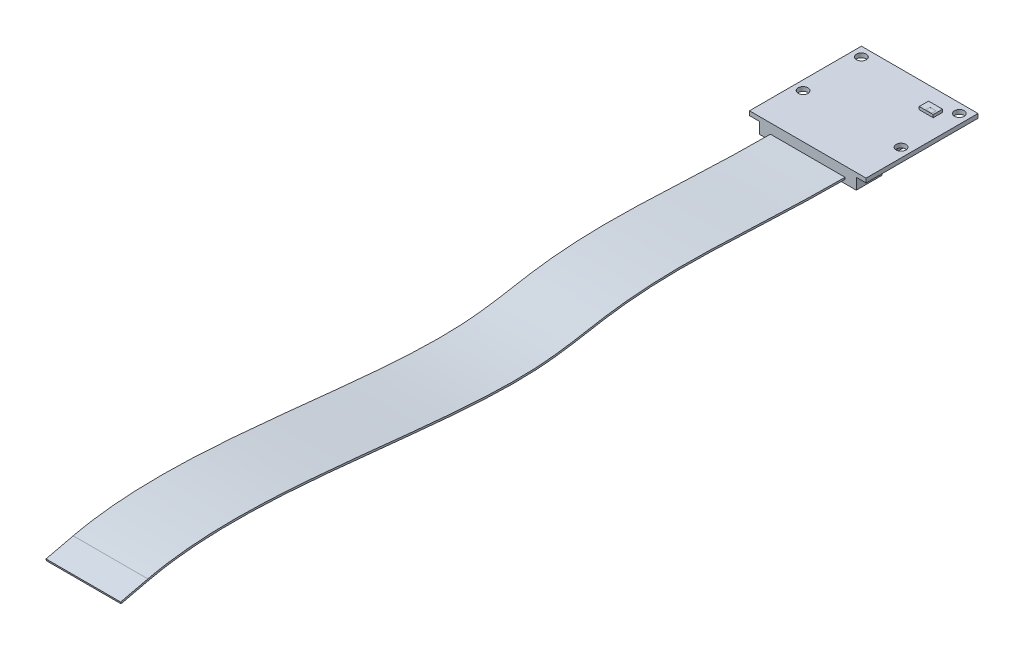
ISO-10303-21;
HEADER;
FILE_DESCRIPTION(('STEP AP214'),'2;1');
FILE_NAME('part.step','',(''),(''),'','','');
FILE_SCHEMA(('AUTOMOTIVE_DESIGN { 1 0 10303 214 1 1 1 1 }'));
ENDSEC;
DATA;
#1=APPLICATION_CONTEXT('core data for automotive mechanical design processes');
#2=APPLICATION_PROTOCOL_DEFINITION('international standard','automotive_design',2000,#1);
#3=PRODUCT_CONTEXT('',#1,'mechanical');
#4=PRODUCT('Part','Part','',(#3));
#5=PRODUCT_RELATED_PRODUCT_CATEGORY('part','',(#4));
#6=PRODUCT_DEFINITION_FORMATION('','',#4);
#7=PRODUCT_DEFINITION_CONTEXT('part definition',#1,'design');
#8=PRODUCT_DEFINITION('design','',#6,#7);
#9=PRODUCT_DEFINITION_SHAPE('','',#8);
#10=(LENGTH_UNIT() NAMED_UNIT(*) SI_UNIT(.MILLI.,.METRE.));
#11=(NAMED_UNIT(*) PLANE_ANGLE_UNIT() SI_UNIT($,.RADIAN.));
#12=(NAMED_UNIT(*) SI_UNIT($,.STERADIAN.) SOLID_ANGLE_UNIT());
#13=UNCERTAINTY_MEASURE_WITH_UNIT(LENGTH_MEASURE(1.E-05),#10,'distance_accuracy_value','');
#14=(GEOMETRIC_REPRESENTATION_CONTEXT(3) GLOBAL_UNCERTAINTY_ASSIGNED_CONTEXT((#13)) GLOBAL_UNIT_ASSIGNED_CONTEXT((#10,
#11,#12)) REPRESENTATION_CONTEXT('',''));
#15=CARTESIAN_POINT('',(0.,0.,0.));
#16=DIRECTION('',(0.,0.,1.));
#17=DIRECTION('',(1.,0.,0.));
#18=AXIS2_PLACEMENT_3D('',#15,#16,#17);
#19=CARTESIAN_POINT('',(0.,0.,0.));
#20=DIRECTION('',(0.,1.,0.));
#21=DIRECTION('',(0.,0.,1.));
#22=AXIS2_PLACEMENT_3D('',#19,#20,#21);
#23=PLANE('',#22);
#24=CARTESIAN_POINT('',(-10.5,0.,-12.5));
#25=DIRECTION('',(0.,1.,0.));
#26=DIRECTION('',(0.,0.,-1.));
#27=AXIS2_PLACEMENT_3D('',#24,#25,#26);
#28=CIRCLE('',#27,1.05);
#29=CARTESIAN_POINT('',(-10.5,0.,-13.55));
#30=VERTEX_POINT('',#29);
#31=EDGE_CURVE('E504',#30,#30,#28,.T.);
#32=ORIENTED_EDGE('',*,*,#31,.F.);
#33=EDGE_LOOP('',(#32));
#34=FACE_BOUND('',#33,.T.);
#35=CARTESIAN_POINT('',(-10.5,0.,0.));
#36=DIRECTION('',(0.,1.,0.));
#37=DIRECTION('',(0.,0.,-1.));
#38=AXIS2_PLACEMENT_3D('',#35,#36,#37);
#39=CIRCLE('',#38,1.05);
#40=CARTESIAN_POINT('',(-10.5,0.,-1.05));
#41=VERTEX_POINT('',#40);
#42=EDGE_CURVE('E510',#41,#41,#39,.T.);
#43=ORIENTED_EDGE('',*,*,#42,.F.);
#44=EDGE_LOOP('',(#43));
#45=FACE_BOUND('',#44,.T.);
#46=CARTESIAN_POINT('',(10.5,0.,0.));
#47=DIRECTION('',(0.,1.,0.));
#48=DIRECTION('',(0.,0.,1.));
#49=AXIS2_PLACEMENT_3D('',#46,#47,#48);
#50=CIRCLE('',#49,1.05);
#51=CARTESIAN_POINT('',(10.5,0.,1.05));
#52=VERTEX_POINT('',#51);
#53=EDGE_CURVE('E515',#52,#52,#50,.T.);
#54=ORIENTED_EDGE('',*,*,#53,.F.);
#55=EDGE_LOOP('',(#54));
#56=FACE_BOUND('',#55,.T.);
#57=CARTESIAN_POINT('',(10.5,0.,-12.5));
#58=DIRECTION('',(0.,1.,0.));
#59=DIRECTION('',(0.,0.,1.));
#60=AXIS2_PLACEMENT_3D('',#57,#58,#59);
#61=CIRCLE('',#60,1.05);
#62=CARTESIAN_POINT('',(10.5,0.,-11.45));
#63=VERTEX_POINT('',#62);
#64=EDGE_CURVE('E521',#63,#63,#61,.T.);
#65=ORIENTED_EDGE('',*,*,#64,.F.);
#66=EDGE_LOOP('',(#65));
#67=FACE_BOUND('',#66,.T.);
#68=DIRECTION('',(0.,0.,1.));
#69=VECTOR('',#68,1.);
#70=CARTESIAN_POINT('',(-12.5,0.,-14.5));
#71=LINE('',#70,#69);
#72=CARTESIAN_POINT('',(-12.5,0.,-14.5));
#73=VERTEX_POINT('',#72);
#74=CARTESIAN_POINT('',(-12.5,0.,9.5));
#75=VERTEX_POINT('',#74);
#76=EDGE_CURVE('E458',#73,#75,#71,.T.);
#77=ORIENTED_EDGE('',*,*,#76,.T.);
#78=DIRECTION('',(1.,0.,0.));
#79=VECTOR('',#78,1.);
#80=CARTESIAN_POINT('',(-12.5,0.,9.5));
#81=LINE('',#80,#79);
#82=CARTESIAN_POINT('',(12.5,0.,9.5));
#83=VERTEX_POINT('',#82);
#84=EDGE_CURVE('E461',#75,#83,#81,.T.);
#85=ORIENTED_EDGE('',*,*,#84,.T.);
#86=DIRECTION('',(0.,0.,-1.));
#87=VECTOR('',#86,1.);
#88=CARTESIAN_POINT('',(12.5,0.,-14.5));
#89=LINE('',#88,#87);
#90=CARTESIAN_POINT('',(12.5,0.,-14.5));
#91=VERTEX_POINT('',#90);
#92=EDGE_CURVE('E465',#83,#91,#89,.T.);
#93=ORIENTED_EDGE('',*,*,#92,.T.);
#94=DIRECTION('',(-1.,0.,0.));
#95=VECTOR('',#94,1.);
#96=CARTESIAN_POINT('',(-12.5,0.,-14.5));
#97=LINE('',#96,#95);
#98=EDGE_CURVE('E468',#91,#73,#97,.T.);
#99=ORIENTED_EDGE('',*,*,#98,.T.);
#100=EDGE_LOOP('',(#77,#85,#93,#99));
#101=FACE_BOUND('',#100,.T.);
#102=DIRECTION('',(1.,0.,0.));
#103=VECTOR('',#102,1.);
#104=CARTESIAN_POINT('',(5.5,0.,-8.90000000000001));
#105=LINE('',#104,#103);
#106=CARTESIAN_POINT('',(5.5,0.,-8.90000000000001));
#107=VERTEX_POINT('',#106);
#108=CARTESIAN_POINT('',(8.5,0.,-8.90000000000001));
#109=VERTEX_POINT('',#108);
#110=EDGE_CURVE('E280',#107,#109,#105,.T.);
#111=ORIENTED_EDGE('',*,*,#110,.F.);
#112=DIRECTION('',(0.,0.,1.));
#113=VECTOR('',#112,1.);
#114=CARTESIAN_POINT('',(5.5,0.,-10.9));
#115=LINE('',#114,#113);
#116=CARTESIAN_POINT('',(5.5,0.,-10.9));
#117=VERTEX_POINT('',#116);
#118=EDGE_CURVE('E263',#117,#107,#115,.T.);
#119=ORIENTED_EDGE('',*,*,#118,.F.);
#120=DIRECTION('',(-1.,0.,0.));
#121=VECTOR('',#120,1.);
#122=CARTESIAN_POINT('',(5.5,0.,-10.9));
#123=LINE('',#122,#121);
#124=CARTESIAN_POINT('',(8.5,0.,-10.9));
#125=VERTEX_POINT('',#124);
#126=EDGE_CURVE('E271',#125,#117,#123,.T.);
#127=ORIENTED_EDGE('',*,*,#126,.F.);
#128=DIRECTION('',(0.,0.,-1.));
#129=VECTOR('',#128,1.);
#130=CARTESIAN_POINT('',(8.5,0.,-10.9));
#131=LINE('',#130,#129);
#132=EDGE_CURVE('E282',#109,#125,#131,.T.);
#133=ORIENTED_EDGE('',*,*,#132,.F.);
#134=EDGE_LOOP('',(#111,#119,#127,#133));
#135=FACE_BOUND('',#134,.T.);
#136=ADVANCED_FACE('F53',(#34,#45,#56,#67,#101,#135),#23,.T.);
#137=CARTESIAN_POINT('',(0.,-0.9,0.));
#138=DIRECTION('',(0.,1.,0.));
#139=DIRECTION('',(0.,0.,1.));
#140=AXIS2_PLACEMENT_3D('',#137,#138,#139);
#141=PLANE('',#140);
#142=DIRECTION('',(0.,0.,-1.));
#143=VECTOR('',#142,1.);
#144=CARTESIAN_POINT('',(-10.4,-0.9,9.5));
#145=LINE('',#144,#143);
#146=CARTESIAN_POINT('',(-10.4,-0.9,9.5));
#147=VERTEX_POINT('',#146);
#148=CARTESIAN_POINT('',(-10.4,-0.9,4.));
#149=VERTEX_POINT('',#148);
#150=EDGE_CURVE('E400',#147,#149,#145,.T.);
#151=ORIENTED_EDGE('',*,*,#150,.F.);
#152=DIRECTION('',(1.,0.,0.));
#153=VECTOR('',#152,1.);
#154=CARTESIAN_POINT('',(-12.5,-0.9,9.5));
#155=LINE('',#154,#153);
#156=CARTESIAN_POINT('',(-12.5,-0.9,9.5));
#157=VERTEX_POINT('',#156);
#158=EDGE_CURVE('E443',#157,#147,#155,.T.);
#159=ORIENTED_EDGE('',*,*,#158,.F.);
#160=DIRECTION('',(0.,0.,1.));
#161=VECTOR('',#160,1.);
#162=CARTESIAN_POINT('',(-12.5,-0.9,-14.5));
#163=LINE('',#162,#161);
#164=CARTESIAN_POINT('',(-12.5,-0.9,-14.5));
#165=VERTEX_POINT('',#164);
#166=EDGE_CURVE('E444',#165,#157,#163,.T.);
#167=ORIENTED_EDGE('',*,*,#166,.F.);
#168=DIRECTION('',(-1.,0.,0.));
#169=VECTOR('',#168,1.);
#170=CARTESIAN_POINT('',(-12.5,-0.9,-14.5));
#171=LINE('',#170,#169);
#172=CARTESIAN_POINT('',(12.5,-0.9,-14.5));
#173=VERTEX_POINT('',#172);
#174=EDGE_CURVE('E454',#173,#165,#171,.T.);
#175=ORIENTED_EDGE('',*,*,#174,.F.);
#176=DIRECTION('',(0.,0.,-1.));
#177=VECTOR('',#176,1.);
#178=CARTESIAN_POINT('',(12.5,-0.9,-14.5));
#179=LINE('',#178,#177);
#180=CARTESIAN_POINT('',(12.5,-0.9,9.5));
#181=VERTEX_POINT('',#180);
#182=EDGE_CURVE('E450',#181,#173,#179,.T.);
#183=ORIENTED_EDGE('',*,*,#182,.F.);
#184=CARTESIAN_POINT('',(10.4,-0.9,9.5));
#185=VERTEX_POINT('',#184);
#186=EDGE_CURVE('E440',#185,#181,#155,.T.);
#187=ORIENTED_EDGE('',*,*,#186,.F.);
#188=DIRECTION('',(0.,0.,1.));
#189=VECTOR('',#188,1.);
#190=CARTESIAN_POINT('',(10.4,-0.9,9.5));
#191=LINE('',#190,#189);
#192=CARTESIAN_POINT('',(10.4,-0.9,4.));
#193=VERTEX_POINT('',#192);
#194=EDGE_CURVE('E405',#193,#185,#191,.T.);
#195=ORIENTED_EDGE('',*,*,#194,.F.);
#196=DIRECTION('',(1.,0.,0.));
#197=VECTOR('',#196,1.);
#198=CARTESIAN_POINT('',(-10.4,-0.9,4.));
#199=LINE('',#198,#197);
#200=EDGE_CURVE('E412',#149,#193,#199,.T.);
#201=ORIENTED_EDGE('',*,*,#200,.F.);
#202=EDGE_LOOP('',(#151,#159,#167,#175,#183,#187,#195,#201));
#203=FACE_BOUND('',#202,.T.);
#204=CARTESIAN_POINT('',(-10.5,-0.9,-12.5));
#205=DIRECTION('',(0.,1.,0.));
#206=DIRECTION('',(0.,0.,-1.));
#207=AXIS2_PLACEMENT_3D('',#204,#205,#206);
#208=CIRCLE('',#207,1.05);
#209=CARTESIAN_POINT('',(-10.5,-0.9,-13.55));
#210=VERTEX_POINT('',#209);
#211=EDGE_CURVE('E506',#210,#210,#208,.T.);
#212=ORIENTED_EDGE('',*,*,#211,.T.);
#213=EDGE_LOOP('',(#212));
#214=FACE_BOUND('',#213,.T.);
#215=CARTESIAN_POINT('',(-10.5,-0.9,0.));
#216=DIRECTION('',(0.,1.,0.));
#217=DIRECTION('',(0.,0.,-1.));
#218=AXIS2_PLACEMENT_3D('',#215,#216,#217);
#219=CIRCLE('',#218,1.05);
#220=CARTESIAN_POINT('',(-10.5,-0.9,-1.05));
#221=VERTEX_POINT('',#220);
#222=EDGE_CURVE('E512',#221,#221,#219,.T.);
#223=ORIENTED_EDGE('',*,*,#222,.T.);
#224=EDGE_LOOP('',(#223));
#225=FACE_BOUND('',#224,.T.);
#226=CARTESIAN_POINT('',(10.5,-0.9,0.));
#227=DIRECTION('',(0.,1.,0.));
#228=DIRECTION('',(0.,0.,1.));
#229=AXIS2_PLACEMENT_3D('',#226,#227,#228);
#230=CIRCLE('',#229,1.05);
#231=CARTESIAN_POINT('',(10.5,-0.9,1.05));
#232=VERTEX_POINT('',#231);
#233=EDGE_CURVE('E518',#232,#232,#230,.T.);
#234=ORIENTED_EDGE('',*,*,#233,.T.);
#235=EDGE_LOOP('',(#234));
#236=FACE_BOUND('',#235,.T.);
#237=CARTESIAN_POINT('',(10.5,-0.9,-12.5));
#238=DIRECTION('',(0.,1.,0.));
#239=DIRECTION('',(0.,0.,1.));
#240=AXIS2_PLACEMENT_3D('',#237,#238,#239);
#241=CIRCLE('',#240,1.05);
#242=CARTESIAN_POINT('',(10.5,-0.9,-11.45));
#243=VERTEX_POINT('',#242);
#244=EDGE_CURVE('E462',#243,#243,#241,.T.);
#245=ORIENTED_EDGE('',*,*,#244,.T.);
#246=EDGE_LOOP('',(#245));
#247=FACE_BOUND('',#246,.T.);
#248=DIRECTION('',(0.,0.,-1.));
#249=VECTOR('',#248,1.);
#250=CARTESIAN_POINT('',(-9.,-0.9,-0.900000000000005));
#251=LINE('',#250,#249);
#252=CARTESIAN_POINT('',(-9.,-0.9,-0.900000000000005));
#253=VERTEX_POINT('',#252);
#254=CARTESIAN_POINT('',(-9.,-0.9,-12.5));
#255=VERTEX_POINT('',#254);
#256=EDGE_CURVE('E367',#253,#255,#251,.T.);
#257=ORIENTED_EDGE('',*,*,#256,.F.);
#258=DIRECTION('',(-1.,0.,0.));
#259=VECTOR('',#258,1.);
#260=CARTESIAN_POINT('',(-9.,-0.9,-0.900000000000005));
#261=LINE('',#260,#259);
#262=CARTESIAN_POINT('',(8.7,-0.9,-0.900000000000005));
#263=VERTEX_POINT('',#262);
#264=EDGE_CURVE('E372',#263,#253,#261,.T.);
#265=ORIENTED_EDGE('',*,*,#264,.F.);
#266=DIRECTION('',(0.,0.,1.));
#267=VECTOR('',#266,1.);
#268=CARTESIAN_POINT('',(8.7,-0.9,-0.900000000000005));
#269=LINE('',#268,#267);
#270=CARTESIAN_POINT('',(8.7,-0.9,-12.5));
#271=VERTEX_POINT('',#270);
#272=EDGE_CURVE('E384',#271,#263,#269,.T.);
#273=ORIENTED_EDGE('',*,*,#272,.F.);
#274=DIRECTION('',(1.,0.,0.));
#275=VECTOR('',#274,1.);
#276=CARTESIAN_POINT('',(-9.,-0.9,-12.5));
#277=LINE('',#276,#275);
#278=EDGE_CURVE('E381',#255,#271,#277,.T.);
#279=ORIENTED_EDGE('',*,*,#278,.F.);
#280=EDGE_LOOP('',(#257,#265,#273,#279));
#281=FACE_BOUND('',#280,.T.);
#282=ADVANCED_FACE('F490',(#203,#214,#225,#236,#247,#281),#141,.F.);
#283=CARTESIAN_POINT('',(-12.5,-0.9,-14.5));
#284=DIRECTION('',(-1.,0.,0.));
#285=DIRECTION('',(0.,0.,1.));
#286=AXIS2_PLACEMENT_3D('',#283,#284,#285);
#287=PLANE('',#286);
#288=ORIENTED_EDGE('',*,*,#76,.F.);
#289=DIRECTION('',(0.,1.,0.));
#290=VECTOR('',#289,1.);
#291=CARTESIAN_POINT('',(-12.5,-0.9,-14.5));
#292=LINE('',#291,#290);
#293=EDGE_CURVE('E12',#165,#73,#292,.T.);
#294=ORIENTED_EDGE('',*,*,#293,.F.);
#295=ORIENTED_EDGE('',*,*,#166,.T.);
#296=DIRECTION('',(0.,1.,0.));
#297=VECTOR('',#296,1.);
#298=CARTESIAN_POINT('',(-12.5,-0.9,9.5));
#299=LINE('',#298,#297);
#300=EDGE_CURVE('E457',#157,#75,#299,.T.);
#301=ORIENTED_EDGE('',*,*,#300,.T.);
#302=EDGE_LOOP('',(#288,#294,#295,#301));
#303=FACE_BOUND('',#302,.T.);
#304=ADVANCED_FACE('F55',(#303),#287,.T.);
#305=CARTESIAN_POINT('',(-12.5,-0.9,-14.5));
#306=DIRECTION('',(0.,0.,-1.));
#307=DIRECTION('',(-1.,0.,0.));
#308=AXIS2_PLACEMENT_3D('',#305,#306,#307);
#309=PLANE('',#308);
#310=ORIENTED_EDGE('',*,*,#98,.F.);
#311=DIRECTION('',(0.,1.,0.));
#312=VECTOR('',#311,1.);
#313=CARTESIAN_POINT('',(12.5,-0.9,-14.5));
#314=LINE('',#313,#312);
#315=EDGE_CURVE('E62',#173,#91,#314,.T.);
#316=ORIENTED_EDGE('',*,*,#315,.F.);
#317=ORIENTED_EDGE('',*,*,#174,.T.);
#318=ORIENTED_EDGE('',*,*,#293,.T.);
#319=EDGE_LOOP('',(#310,#316,#317,#318));
#320=FACE_BOUND('',#319,.T.);
#321=ADVANCED_FACE('F487',(#320),#309,.T.);
#322=CARTESIAN_POINT('',(12.5,-0.9,-14.5));
#323=DIRECTION('',(1.,0.,0.));
#324=DIRECTION('',(0.,0.,-1.));
#325=AXIS2_PLACEMENT_3D('',#322,#323,#324);
#326=PLANE('',#325);
#327=ORIENTED_EDGE('',*,*,#92,.F.);
#328=DIRECTION('',(0.,1.,0.));
#329=VECTOR('',#328,1.);
#330=CARTESIAN_POINT('',(12.5,-0.9,9.5));
#331=LINE('',#330,#329);
#332=EDGE_CURVE('E472',#181,#83,#331,.T.);
#333=ORIENTED_EDGE('',*,*,#332,.F.);
#334=ORIENTED_EDGE('',*,*,#182,.T.);
#335=ORIENTED_EDGE('',*,*,#315,.T.);
#336=EDGE_LOOP('',(#327,#333,#334,#335));
#337=FACE_BOUND('',#336,.T.);
#338=ADVANCED_FACE('F545',(#337),#326,.T.);
#339=CARTESIAN_POINT('',(-12.5,-0.9,9.5));
#340=DIRECTION('',(0.,0.,1.));
#341=DIRECTION('',(1.,0.,0.));
#342=AXIS2_PLACEMENT_3D('',#339,#340,#341);
#343=PLANE('',#342);
#344=DIRECTION('',(0.,-1.,0.));
#345=VECTOR('',#344,1.);
#346=CARTESIAN_POINT('',(-8.,-2.1,9.5));
#347=LINE('',#346,#345);
#348=CARTESIAN_POINT('',(-8.,-2.1,9.5));
#349=VERTEX_POINT('',#348);
#350=CARTESIAN_POINT('',(-8.,-2.5,9.5));
#351=VERTEX_POINT('',#350);
#352=EDGE_CURVE('E294',#349,#351,#347,.T.);
#353=ORIENTED_EDGE('',*,*,#352,.F.);
#354=DIRECTION('',(-1.,0.,0.));
#355=VECTOR('',#354,1.);
#356=CARTESIAN_POINT('',(-8.,-2.1,9.5));
#357=LINE('',#356,#355);
#358=CARTESIAN_POINT('',(8.,-2.1,9.5));
#359=VERTEX_POINT('',#358);
#360=EDGE_CURVE('E304',#359,#349,#357,.T.);
#361=ORIENTED_EDGE('',*,*,#360,.F.);
#362=DIRECTION('',(0.,1.,0.));
#363=VECTOR('',#362,1.);
#364=CARTESIAN_POINT('',(8.,-2.1,9.5));
#365=LINE('',#364,#363);
#366=CARTESIAN_POINT('',(8.,-2.5,9.5));
#367=VERTEX_POINT('',#366);
#368=EDGE_CURVE('E301',#367,#359,#365,.T.);
#369=ORIENTED_EDGE('',*,*,#368,.F.);
#370=DIRECTION('',(1.,0.,0.));
#371=VECTOR('',#370,1.);
#372=CARTESIAN_POINT('',(-8.,-2.5,9.5));
#373=LINE('',#372,#371);
#374=EDGE_CURVE('E297',#351,#367,#373,.T.);
#375=ORIENTED_EDGE('',*,*,#374,.F.);
#376=EDGE_LOOP('',(#353,#361,#369,#375));
#377=FACE_BOUND('',#376,.T.);
#378=ORIENTED_EDGE('',*,*,#84,.F.);
#379=ORIENTED_EDGE('',*,*,#300,.F.);
#380=ORIENTED_EDGE('',*,*,#158,.T.);
#381=DIRECTION('',(0.,1.,0.));
#382=VECTOR('',#381,1.);
#383=CARTESIAN_POINT('',(-10.4,-3.3,9.5));
#384=LINE('',#383,#382);
#385=CARTESIAN_POINT('',(-10.4,-3.3,9.5));
#386=VERTEX_POINT('',#385);
#387=EDGE_CURVE('E411',#386,#147,#384,.T.);
#388=ORIENTED_EDGE('',*,*,#387,.F.);
#389=DIRECTION('',(-1.,0.,0.));
#390=VECTOR('',#389,1.);
#391=CARTESIAN_POINT('',(-10.4,-3.3,9.5));
#392=LINE('',#391,#390);
#393=CARTESIAN_POINT('',(10.4,-3.3,9.5));
#394=VERTEX_POINT('',#393);
#395=EDGE_CURVE('E409',#394,#386,#392,.T.);
#396=ORIENTED_EDGE('',*,*,#395,.F.);
#397=DIRECTION('',(0.,1.,0.));
#398=VECTOR('',#397,1.);
#399=CARTESIAN_POINT('',(10.4,-3.3,9.5));
#400=LINE('',#399,#398);
#401=EDGE_CURVE('E424',#394,#185,#400,.T.);
#402=ORIENTED_EDGE('',*,*,#401,.T.);
#403=ORIENTED_EDGE('',*,*,#186,.T.);
#404=ORIENTED_EDGE('',*,*,#332,.T.);
#405=EDGE_LOOP('',(#378,#379,#380,#388,#396,#402,#403,#404));
#406=FACE_BOUND('',#405,.T.);
#407=ADVANCED_FACE('F480',(#377,#406),#343,.T.);
#408=CARTESIAN_POINT('',(10.5,-0.9,-12.5));
#409=DIRECTION('',(0.,1.,0.));
#410=DIRECTION('',(0.,0.,1.));
#411=AXIS2_PLACEMENT_3D('',#408,#409,#410);
#412=CYLINDRICAL_SURFACE('',#411,1.05);
#413=ORIENTED_EDGE('',*,*,#244,.F.);
#414=EDGE_LOOP('',(#413));
#415=FACE_BOUND('',#414,.T.);
#416=ORIENTED_EDGE('',*,*,#64,.T.);
#417=EDGE_LOOP('',(#416));
#418=FACE_BOUND('',#417,.T.);
#419=ADVANCED_FACE('F528',(#415,#418),#412,.F.);
#420=CARTESIAN_POINT('',(10.5,-0.9,0.));
#421=DIRECTION('',(0.,1.,0.));
#422=DIRECTION('',(0.,0.,1.));
#423=AXIS2_PLACEMENT_3D('',#420,#421,#422);
#424=CYLINDRICAL_SURFACE('',#423,1.05);
#425=ORIENTED_EDGE('',*,*,#233,.F.);
#426=EDGE_LOOP('',(#425));
#427=FACE_BOUND('',#426,.T.);
#428=ORIENTED_EDGE('',*,*,#53,.T.);
#429=EDGE_LOOP('',(#428));
#430=FACE_BOUND('',#429,.T.);
#431=ADVANCED_FACE('F555',(#427,#430),#424,.F.);
#432=CARTESIAN_POINT('',(-10.5,-0.9,0.));
#433=DIRECTION('',(0.,1.,0.));
#434=DIRECTION('',(0.,0.,1.));
#435=AXIS2_PLACEMENT_3D('',#432,#433,#434);
#436=CYLINDRICAL_SURFACE('',#435,1.05);
#437=ORIENTED_EDGE('',*,*,#222,.F.);
#438=EDGE_LOOP('',(#437));
#439=FACE_BOUND('',#438,.T.);
#440=ORIENTED_EDGE('',*,*,#42,.T.);
#441=EDGE_LOOP('',(#440));
#442=FACE_BOUND('',#441,.T.);
#443=ADVANCED_FACE('F623',(#439,#442),#436,.F.);
#444=CARTESIAN_POINT('',(-10.5,-0.9,-12.5));
#445=DIRECTION('',(0.,1.,0.));
#446=DIRECTION('',(0.,0.,1.));
#447=AXIS2_PLACEMENT_3D('',#444,#445,#446);
#448=CYLINDRICAL_SURFACE('',#447,1.05);
#449=ORIENTED_EDGE('',*,*,#211,.F.);
#450=EDGE_LOOP('',(#449));
#451=FACE_BOUND('',#450,.T.);
#452=ORIENTED_EDGE('',*,*,#31,.T.);
#453=EDGE_LOOP('',(#452));
#454=FACE_BOUND('',#453,.T.);
#455=ADVANCED_FACE('F620',(#451,#454),#448,.F.);
#456=CARTESIAN_POINT('',(-10.4,-3.3,9.5));
#457=DIRECTION('',(1.,0.,0.));
#458=DIRECTION('',(0.,0.,-1.));
#459=AXIS2_PLACEMENT_3D('',#456,#457,#458);
#460=PLANE('',#459);
#461=ORIENTED_EDGE('',*,*,#150,.T.);
#462=DIRECTION('',(0.,1.,0.));
#463=VECTOR('',#462,1.);
#464=CARTESIAN_POINT('',(-10.4,-3.3,4.));
#465=LINE('',#464,#463);
#466=CARTESIAN_POINT('',(-10.4,-3.3,4.));
#467=VERTEX_POINT('',#466);
#468=EDGE_CURVE('E430',#467,#149,#465,.T.);
#469=ORIENTED_EDGE('',*,*,#468,.F.);
#470=DIRECTION('',(0.,0.,-1.));
#471=VECTOR('',#470,1.);
#472=CARTESIAN_POINT('',(-10.4,-3.3,9.5));
#473=LINE('',#472,#471);
#474=EDGE_CURVE('E401',#386,#467,#473,.T.);
#475=ORIENTED_EDGE('',*,*,#474,.F.);
#476=ORIENTED_EDGE('',*,*,#387,.T.);
#477=EDGE_LOOP('',(#461,#469,#475,#476));
#478=FACE_BOUND('',#477,.T.);
#479=ADVANCED_FACE('F494',(#478),#460,.F.);
#480=CARTESIAN_POINT('',(-10.4,-3.3,4.));
#481=DIRECTION('',(0.,0.,1.));
#482=DIRECTION('',(1.,0.,0.));
#483=AXIS2_PLACEMENT_3D('',#480,#481,#482);
#484=PLANE('',#483);
#485=ORIENTED_EDGE('',*,*,#200,.T.);
#486=DIRECTION('',(0.,1.,0.));
#487=VECTOR('',#486,1.);
#488=CARTESIAN_POINT('',(10.4,-3.3,4.));
#489=LINE('',#488,#487);
#490=CARTESIAN_POINT('',(10.4,-3.3,4.));
#491=VERTEX_POINT('',#490);
#492=EDGE_CURVE('E417',#491,#193,#489,.T.);
#493=ORIENTED_EDGE('',*,*,#492,.F.);
#494=DIRECTION('',(1.,0.,0.));
#495=VECTOR('',#494,1.);
#496=CARTESIAN_POINT('',(-10.4,-3.3,4.));
#497=LINE('',#496,#495);
#498=EDGE_CURVE('E404',#467,#491,#497,.T.);
#499=ORIENTED_EDGE('',*,*,#498,.F.);
#500=ORIENTED_EDGE('',*,*,#468,.T.);
#501=EDGE_LOOP('',(#485,#493,#499,#500));
#502=FACE_BOUND('',#501,.T.);
#503=ADVANCED_FACE('F503',(#502),#484,.F.);
#504=CARTESIAN_POINT('',(10.4,-3.3,9.5));
#505=DIRECTION('',(-1.,0.,0.));
#506=DIRECTION('',(0.,0.,1.));
#507=AXIS2_PLACEMENT_3D('',#504,#505,#506);
#508=PLANE('',#507);
#509=ORIENTED_EDGE('',*,*,#194,.T.);
#510=ORIENTED_EDGE('',*,*,#401,.F.);
#511=DIRECTION('',(0.,0.,1.));
#512=VECTOR('',#511,1.);
#513=CARTESIAN_POINT('',(10.4,-3.3,9.5));
#514=LINE('',#513,#512);
#515=EDGE_CURVE('E407',#491,#394,#514,.T.);
#516=ORIENTED_EDGE('',*,*,#515,.F.);
#517=ORIENTED_EDGE('',*,*,#492,.T.);
#518=EDGE_LOOP('',(#509,#510,#516,#517));
#519=FACE_BOUND('',#518,.T.);
#520=ADVANCED_FACE('F501',(#519),#508,.F.);
#521=CARTESIAN_POINT('',(0.,-3.3,0.));
#522=DIRECTION('',(0.,-1.,0.));
#523=DIRECTION('',(0.,0.,-1.));
#524=AXIS2_PLACEMENT_3D('',#521,#522,#523);
#525=PLANE('',#524);
#526=ORIENTED_EDGE('',*,*,#474,.T.);
#527=ORIENTED_EDGE('',*,*,#498,.T.);
#528=ORIENTED_EDGE('',*,*,#515,.T.);
#529=ORIENTED_EDGE('',*,*,#395,.T.);
#530=EDGE_LOOP('',(#526,#527,#528,#529));
#531=FACE_BOUND('',#530,.T.);
#532=ADVANCED_FACE('F497',(#531),#525,.T.);
#533=CARTESIAN_POINT('',(-9.,-2.2,-0.900000000000005));
#534=DIRECTION('',(1.,0.,0.));
#535=DIRECTION('',(0.,0.,-1.));
#536=AXIS2_PLACEMENT_3D('',#533,#534,#535);
#537=PLANE('',#536);
#538=ORIENTED_EDGE('',*,*,#256,.T.);
#539=DIRECTION('',(0.,1.,0.));
#540=VECTOR('',#539,1.);
#541=CARTESIAN_POINT('',(-9.,-2.2,-12.5));
#542=LINE('',#541,#540);
#543=CARTESIAN_POINT('',(-9.,-2.2,-12.5));
#544=VERTEX_POINT('',#543);
#545=EDGE_CURVE('E397',#544,#255,#542,.T.);
#546=ORIENTED_EDGE('',*,*,#545,.F.);
#547=DIRECTION('',(0.,0.,-1.));
#548=VECTOR('',#547,1.);
#549=CARTESIAN_POINT('',(-9.,-2.2,-0.900000000000005));
#550=LINE('',#549,#548);
#551=CARTESIAN_POINT('',(-9.,-2.2,-0.900000000000005));
#552=VERTEX_POINT('',#551);
#553=EDGE_CURVE('E368',#552,#544,#550,.T.);
#554=ORIENTED_EDGE('',*,*,#553,.F.);
#555=DIRECTION('',(0.,1.,0.));
#556=VECTOR('',#555,1.);
#557=CARTESIAN_POINT('',(-9.,-2.2,-0.900000000000005));
#558=LINE('',#557,#556);
#559=EDGE_CURVE('E378',#552,#253,#558,.T.);
#560=ORIENTED_EDGE('',*,*,#559,.T.);
#561=EDGE_LOOP('',(#538,#546,#554,#560));
#562=FACE_BOUND('',#561,.T.);
#563=ADVANCED_FACE('F607',(#562),#537,.F.);
#564=CARTESIAN_POINT('',(-9.,-2.2,-12.5));
#565=DIRECTION('',(0.,0.,1.));
#566=DIRECTION('',(1.,0.,0.));
#567=AXIS2_PLACEMENT_3D('',#564,#565,#566);
#568=PLANE('',#567);
#569=ORIENTED_EDGE('',*,*,#278,.T.);
#570=DIRECTION('',(0.,1.,0.));
#571=VECTOR('',#570,1.);
#572=CARTESIAN_POINT('',(8.7,-2.2,-12.5));
#573=LINE('',#572,#571);
#574=CARTESIAN_POINT('',(8.7,-2.2,-12.5));
#575=VERTEX_POINT('',#574);
#576=EDGE_CURVE('E394',#575,#271,#573,.T.);
#577=ORIENTED_EDGE('',*,*,#576,.F.);
#578=DIRECTION('',(1.,0.,0.));
#579=VECTOR('',#578,1.);
#580=CARTESIAN_POINT('',(-9.,-2.2,-12.5));
#581=LINE('',#580,#579);
#582=EDGE_CURVE('E371',#544,#575,#581,.T.);
#583=ORIENTED_EDGE('',*,*,#582,.F.);
#584=ORIENTED_EDGE('',*,*,#545,.T.);
#585=EDGE_LOOP('',(#569,#577,#583,#584));
#586=FACE_BOUND('',#585,.T.);
#587=ADVANCED_FACE('F603',(#586),#568,.F.);
#588=CARTESIAN_POINT('',(8.7,-2.2,-0.900000000000005));
#589=DIRECTION('',(-1.,0.,0.));
#590=DIRECTION('',(0.,0.,1.));
#591=AXIS2_PLACEMENT_3D('',#588,#589,#590);
#592=PLANE('',#591);
#593=ORIENTED_EDGE('',*,*,#272,.T.);
#594=DIRECTION('',(0.,1.,0.));
#595=VECTOR('',#594,1.);
#596=CARTESIAN_POINT('',(8.7,-2.2,-0.900000000000005));
#597=LINE('',#596,#595);
#598=CARTESIAN_POINT('',(8.7,-2.2,-0.900000000000005));
#599=VERTEX_POINT('',#598);
#600=EDGE_CURVE('E391',#599,#263,#597,.T.);
#601=ORIENTED_EDGE('',*,*,#600,.F.);
#602=DIRECTION('',(0.,0.,1.));
#603=VECTOR('',#602,1.);
#604=CARTESIAN_POINT('',(8.7,-2.2,-0.900000000000005));
#605=LINE('',#604,#603);
#606=EDGE_CURVE('E374',#575,#599,#605,.T.);
#607=ORIENTED_EDGE('',*,*,#606,.F.);
#608=ORIENTED_EDGE('',*,*,#576,.T.);
#609=EDGE_LOOP('',(#593,#601,#607,#608));
#610=FACE_BOUND('',#609,.T.);
#611=ADVANCED_FACE('F599',(#610),#592,.F.);
#612=CARTESIAN_POINT('',(-9.,-2.2,-0.900000000000005));
#613=DIRECTION('',(0.,0.,-1.));
#614=DIRECTION('',(-1.,0.,0.));
#615=AXIS2_PLACEMENT_3D('',#612,#613,#614);
#616=PLANE('',#615);
#617=ORIENTED_EDGE('',*,*,#264,.T.);
#618=ORIENTED_EDGE('',*,*,#559,.F.);
#619=DIRECTION('',(-1.,0.,0.));
#620=VECTOR('',#619,1.);
#621=CARTESIAN_POINT('',(-9.,-2.2,-0.900000000000005));
#622=LINE('',#621,#620);
#623=EDGE_CURVE('E376',#599,#552,#622,.T.);
#624=ORIENTED_EDGE('',*,*,#623,.F.);
#625=ORIENTED_EDGE('',*,*,#600,.T.);
#626=EDGE_LOOP('',(#617,#618,#624,#625));
#627=FACE_BOUND('',#626,.T.);
#628=ADVANCED_FACE('F595',(#627),#616,.F.);
#629=CARTESIAN_POINT('',(0.,-2.2,0.));
#630=DIRECTION('',(0.,-1.,0.));
#631=DIRECTION('',(0.,0.,-1.));
#632=AXIS2_PLACEMENT_3D('',#629,#630,#631);
#633=PLANE('',#632);
#634=ORIENTED_EDGE('',*,*,#553,.T.);
#635=ORIENTED_EDGE('',*,*,#582,.T.);
#636=ORIENTED_EDGE('',*,*,#606,.T.);
#637=ORIENTED_EDGE('',*,*,#623,.T.);
#638=EDGE_LOOP('',(#634,#635,#636,#637));
#639=FACE_BOUND('',#638,.T.);
#640=ADVANCED_FACE('F584',(#639),#633,.T.);
#641=CARTESIAN_POINT('',(-8.,-2.31532924842802,158.905927829852));
#642=DIRECTION('',(0.,-0.973646751768898,-0.228061401315247));
#643=DIRECTION('',(0.,0.228061401315247,-0.973646751768898));
#644=AXIS2_PLACEMENT_3D('',#641,#642,#643);
#645=PLANE('',#644);
#646=DIRECTION('',(1.,0.,0.));
#647=VECTOR('',#646,1.);
#648=CARTESIAN_POINT('',(-8.,-2.31532924842802,158.905927829852));
#649=LINE('',#648,#647);
#650=CARTESIAN_POINT('',(-8.,-2.31532924842804,158.905927829852));
#651=VERTEX_POINT('',#650);
#652=CARTESIAN_POINT('',(8.,-2.31532924842804,158.905927829852));
#653=VERTEX_POINT('',#652);
#654=EDGE_CURVE('E293',#651,#653,#649,.T.);
#655=ORIENTED_EDGE('',*,*,#654,.T.);
#656=DIRECTION('',(0.,-0.228061401315247,0.973646751768898));
#657=VECTOR('',#656,1.);
#658=CARTESIAN_POINT('',(8.,-2.31532924842804,158.905927829852));
#659=LINE('',#658,#657);
#660=CARTESIAN_POINT('',(8.,-3.6836976563195,164.747808340466));
#661=VERTEX_POINT('',#660);
#662=EDGE_CURVE('E361',#653,#661,#659,.T.);
#663=ORIENTED_EDGE('',*,*,#662,.T.);
#664=DIRECTION('',(1.,0.,0.));
#665=VECTOR('',#664,1.);
#666=CARTESIAN_POINT('',(-8.,-3.68369765631948,164.747808340466));
#667=LINE('',#666,#665);
#668=CARTESIAN_POINT('',(-8.,-3.6836976563195,164.747808340466));
#669=VERTEX_POINT('',#668);
#670=EDGE_CURVE('E352',#669,#661,#667,.T.);
#671=ORIENTED_EDGE('',*,*,#670,.F.);
#672=DIRECTION('',(0.,-0.228061401315247,0.973646751768898));
#673=VECTOR('',#672,1.);
#674=CARTESIAN_POINT('',(-8.,-2.31532924842804,158.905927829852));
#675=LINE('',#674,#673);
#676=EDGE_CURVE('E364',#651,#669,#675,.T.);
#677=ORIENTED_EDGE('',*,*,#676,.F.);
#678=EDGE_LOOP('',(#655,#663,#671,#677));
#679=FACE_BOUND('',#678,.T.);
#680=ADVANCED_FACE('F572',(#679),#645,.T.);
#681=CARTESIAN_POINT('',(-8.,-1.92587054772046,158.997152390378));
#682=DIRECTION('',(0.,0.973646751768898,0.228061401315247));
#683=DIRECTION('',(0.,-0.228061401315247,0.973646751768898));
#684=AXIS2_PLACEMENT_3D('',#681,#682,#683);
#685=PLANE('',#684);
#686=DIRECTION('',(-1.,0.,0.));
#687=VECTOR('',#686,1.);
#688=CARTESIAN_POINT('',(-8.,-1.92587054772046,158.997152390378));
#689=LINE('',#688,#687);
#690=CARTESIAN_POINT('',(8.,-1.92587054772046,158.997152390378));
#691=VERTEX_POINT('',#690);
#692=CARTESIAN_POINT('',(-8.,-1.92587054772046,158.997152390378));
#693=VERTEX_POINT('',#692);
#694=EDGE_CURVE('E322',#691,#693,#689,.T.);
#695=ORIENTED_EDGE('',*,*,#694,.T.);
#696=DIRECTION('',(0.,-0.228061401315247,0.973646751768898));
#697=VECTOR('',#696,1.);
#698=CARTESIAN_POINT('',(-8.,-1.92587054772046,158.997152390378));
#699=LINE('',#698,#697);
#700=CARTESIAN_POINT('',(-8.,-3.29423895561192,164.839032900992));
#701=VERTEX_POINT('',#700);
#702=EDGE_CURVE('E355',#693,#701,#699,.T.);
#703=ORIENTED_EDGE('',*,*,#702,.T.);
#704=DIRECTION('',(-1.,0.,0.));
#705=VECTOR('',#704,1.);
#706=CARTESIAN_POINT('',(-8.,-3.29423895561192,164.839032900992));
#707=LINE('',#706,#705);
#708=CARTESIAN_POINT('',(8.,-3.29423895561192,164.839032900992));
#709=VERTEX_POINT('',#708);
#710=EDGE_CURVE('E346',#709,#701,#707,.T.);
#711=ORIENTED_EDGE('',*,*,#710,.F.);
#712=DIRECTION('',(0.,-0.228061401315247,0.973646751768898));
#713=VECTOR('',#712,1.);
#714=CARTESIAN_POINT('',(8.,-1.92587054772046,158.997152390378));
#715=LINE('',#714,#713);
#716=EDGE_CURVE('E358',#691,#709,#715,.T.);
#717=ORIENTED_EDGE('',*,*,#716,.F.);
#718=EDGE_LOOP('',(#695,#703,#711,#717));
#719=FACE_BOUND('',#718,.T.);
#720=ADVANCED_FACE('F576',(#719),#685,.T.);
#721=CARTESIAN_POINT('',(0.,-1.24958077689724,165.317961843754));
#722=DIRECTION('',(0.,-0.228061401315248,0.973646751768898));
#723=DIRECTION('',(1.,0.,0.));
#724=AXIS2_PLACEMENT_3D('',#721,#722,#723);
#725=PLANE('',#724);
#726=DIRECTION('',(0.,-0.973646751768898,-0.228061401315247));
#727=VECTOR('',#726,1.);
#728=CARTESIAN_POINT('',(-8.,-3.29423895561192,164.839032900992));
#729=LINE('',#728,#727);
#730=EDGE_CURVE('E307',#701,#669,#729,.T.);
#731=ORIENTED_EDGE('',*,*,#730,.T.);
#732=ORIENTED_EDGE('',*,*,#670,.T.);
#733=DIRECTION('',(0.,0.973646751768898,0.228061401315247));
#734=VECTOR('',#733,1.);
#735=CARTESIAN_POINT('',(8.,-3.29423895561192,164.839032900992));
#736=LINE('',#735,#734);
#737=EDGE_CURVE('E349',#661,#709,#736,.T.);
#738=ORIENTED_EDGE('',*,*,#737,.T.);
#739=ORIENTED_EDGE('',*,*,#710,.T.);
#740=EDGE_LOOP('',(#731,#732,#738,#739));
#741=FACE_BOUND('',#740,.T.);
#742=ADVANCED_FACE('F574',(#741),#725,.T.);
#743=CARTESIAN_POINT('',(8.,-2.1,9.5));
#744=CARTESIAN_POINT('',(8.,-2.1,16.2848157386726));
#745=CARTESIAN_POINT('',(8.,-1.54259781503022,28.6725716082376));
#746=CARTESIAN_POINT('',(8.,-0.76787191424125,45.0475312167044));
#747=CARTESIAN_POINT('',(8.,-1.40576196427813,55.8105516182767));
#748=CARTESIAN_POINT('',(8.,-2.89972050089828,65.1228989127056));
#749=CARTESIAN_POINT('',(8.,-4.18732262493879,71.0601813195233));
#750=CARTESIAN_POINT('',(8.,-4.69330722989973,85.3630668882272));
#751=CARTESIAN_POINT('',(8.,-2.70854102619628,105.716134492703));
#752=CARTESIAN_POINT('',(8.,0.417197285135822,134.281531699421));
#753=CARTESIAN_POINT('',(8.,-0.187804243362905,151.576946244852));
#754=CARTESIAN_POINT('',(8.,-1.92587054772048,158.997152390378));
#755=CARTESIAN_POINT('',(-8.,-2.1,9.5));
#756=CARTESIAN_POINT('',(-8.,-2.1,16.2848157386726));
#757=CARTESIAN_POINT('',(-8.,-1.54259781503022,28.6725716082376));
#758=CARTESIAN_POINT('',(-8.,-0.76787191424125,45.0475312167044));
#759=CARTESIAN_POINT('',(-8.,-1.40576196427813,55.8105516182767));
#760=CARTESIAN_POINT('',(-8.,-2.89972050089828,65.1228989127056));
#761=CARTESIAN_POINT('',(-8.,-4.18732262493879,71.0601813195233));
#762=CARTESIAN_POINT('',(-8.,-4.69330722989973,85.3630668882272));
#763=CARTESIAN_POINT('',(-8.,-2.70854102619628,105.716134492703));
#764=CARTESIAN_POINT('',(-8.,0.417197285135822,134.281531699421));
#765=CARTESIAN_POINT('',(-8.,-0.187804243362905,151.576946244852));
#766=CARTESIAN_POINT('',(-8.,-1.92587054772048,158.997152390378));
#767=B_SPLINE_SURFACE_WITH_KNOTS('',1,3,((#743,#744,#745,#746,#747,#748,#749,#750,#751,#752,
#753,#754),(#755,#756,#757,#758,#759,#760,#761,#762,#763,#764,#765,#766)),.UNSPECIFIED.,.F.,.F.,
.F.,(2,2),(4,1,1,1,1,1,1,1,1,4),(0.51219512195122,1.),(0.,0.14,0.28,0.414692015463364,
0.420000000000039,0.514692015463364,0.56,0.70666666666671,0.853333333333281,1.),.UNSPECIFIED.);
#768=CARTESIAN_POINT('',(-8.,-2.1,9.5));
#769=CARTESIAN_POINT('',(-8.,-2.1,16.2848157386726));
#770=CARTESIAN_POINT('',(-8.,-1.54259781503022,28.6725716082376));
#771=CARTESIAN_POINT('',(-8.,-0.76787191424125,45.0475312167044));
#772=CARTESIAN_POINT('',(-8.,-1.40576196427813,55.8105516182767));
#773=CARTESIAN_POINT('',(-8.,-2.89972050089828,65.1228989127056));
#774=CARTESIAN_POINT('',(-8.,-4.18732262493879,71.0601813195233));
#775=CARTESIAN_POINT('',(-8.,-4.69330722989973,85.3630668882272));
#776=CARTESIAN_POINT('',(-8.,-2.70854102619628,105.716134492703));
#777=CARTESIAN_POINT('',(-8.,0.417197285135822,134.281531699421));
#778=CARTESIAN_POINT('',(-8.,-0.187804243362905,151.576946244852));
#779=CARTESIAN_POINT('',(-8.,-1.92587054772048,158.997152390378));
#780=B_SPLINE_CURVE_WITH_KNOTS('',3,(#768,#769,#770,#771,#772,#773,#774,#775,#776,#777,#778,
#779),.UNSPECIFIED.,.F.,.F.,(4,1,1,1,1,1,1,1,1,4),(0.,0.14,0.28,0.414692015463364,
0.420000000000039,0.514692015463364,0.56,0.70666666666671,0.853333333333281,1.),.UNSPECIFIED.);
#781=EDGE_CURVE('E298',#349,#693,#780,.T.);
#782=CARTESIAN_POINT('',(8.,-2.1,9.5));
#783=CARTESIAN_POINT('',(8.,-2.1,16.2848157386726));
#784=CARTESIAN_POINT('',(8.,-1.54259781503022,28.6725716082376));
#785=CARTESIAN_POINT('',(8.,-0.76787191424125,45.0475312167044));
#786=CARTESIAN_POINT('',(8.,-1.40576196427813,55.8105516182767));
#787=CARTESIAN_POINT('',(8.,-2.89972050089828,65.1228989127056));
#788=CARTESIAN_POINT('',(8.,-4.18732262493879,71.0601813195233));
#789=CARTESIAN_POINT('',(8.,-4.69330722989973,85.3630668882272));
#790=CARTESIAN_POINT('',(8.,-2.70854102619628,105.716134492703));
#791=CARTESIAN_POINT('',(8.,0.417197285135822,134.281531699421));
#792=CARTESIAN_POINT('',(8.,-0.187804243362905,151.576946244852));
#793=CARTESIAN_POINT('',(8.,-1.92587054772048,158.997152390378));
#794=B_SPLINE_CURVE_WITH_KNOTS('',3,(#782,#783,#784,#785,#786,#787,#788,#789,#790,#791,#792,
#793),.UNSPECIFIED.,.F.,.F.,(4,1,1,1,1,1,1,1,1,4),(0.,0.14,0.28,0.414692015463364,
0.420000000000039,0.514692015463364,0.56,0.70666666666671,0.853333333333281,1.),.UNSPECIFIED.);
#795=EDGE_CURVE('E312',#359,#691,#794,.T.);
#796=ORIENTED_EDGE('',*,*,#360,.T.);
#797=ORIENTED_EDGE('',*,*,#781,.T.);
#798=ORIENTED_EDGE('',*,*,#694,.F.);
#799=ORIENTED_EDGE('',*,*,#795,.F.);
#800=EDGE_LOOP('',(#796,#797,#798,#799));
#801=FACE_BOUND('',#800,.T.);
#802=ADVANCED_FACE('F564',(#801),#767,.T.);
#803=CARTESIAN_POINT('',(8.,-2.5,9.5));
#804=DIRECTION('',(1.,0.,0.));
#805=DIRECTION('',(0.,1.,0.));
#806=AXIS2_PLACEMENT_3D('',#803,#804,#805);
#807=PLANE('',#806);
#808=ORIENTED_EDGE('',*,*,#368,.T.);
#809=ORIENTED_EDGE('',*,*,#795,.T.);
#810=ORIENTED_EDGE('',*,*,#716,.T.);
#811=ORIENTED_EDGE('',*,*,#737,.F.);
#812=ORIENTED_EDGE('',*,*,#662,.F.);
#813=CARTESIAN_POINT('',(8.,-2.5,9.5));
#814=CARTESIAN_POINT('',(8.,-2.49956610737541,16.2926495243257));
#815=CARTESIAN_POINT('',(8.,-1.94129613715644,28.6960729651968));
#816=CARTESIAN_POINT('',(8.,-1.17048364443311,45.0641087442605));
#817=CARTESIAN_POINT('',(8.,-1.80053952426303,55.7478743512725));
#818=CARTESIAN_POINT('',(8.,-3.29445669837904,65.0571104956017));
#819=CARTESIAN_POINT('',(8.,-4.58511063931313,71.0221280101694));
#820=CARTESIAN_POINT('',(8.,-5.09507729351691,85.3865912732487));
#821=CARTESIAN_POINT('',(8.,-3.10354486249497,105.765337300318));
#822=CARTESIAN_POINT('',(8.,0.0138091333469826,134.316434074407));
#823=CARTESIAN_POINT('',(8.,-0.581906094430893,151.527763996164));
#824=CARTESIAN_POINT('',(8.,-2.31532924842804,158.905927829852));
#825=B_SPLINE_CURVE_WITH_KNOTS('',3,(#813,#814,#815,#816,#817,#818,#819,#820,#821,#822,#823,
#824),.UNSPECIFIED.,.F.,.F.,(4,1,1,1,1,1,1,1,1,4),(0.,0.14,0.28,0.414692015463364,
0.420000000000039,0.514692015463364,0.56,0.70666666666671,0.853333333333281,1.),.UNSPECIFIED.);
#826=EDGE_CURVE('E321',#367,#653,#825,.T.);
#827=ORIENTED_EDGE('',*,*,#826,.F.);
#828=EDGE_LOOP('',(#808,#809,#810,#811,#812,#827));
#829=FACE_BOUND('',#828,.T.);
#830=ADVANCED_FACE('F566',(#829),#807,.T.);
#831=CARTESIAN_POINT('',(-8.,-2.5,9.5));
#832=CARTESIAN_POINT('',(-8.,-2.49956610737541,16.2926495243257));
#833=CARTESIAN_POINT('',(-8.,-1.94129613715644,28.6960729651968));
#834=CARTESIAN_POINT('',(-8.,-1.17048364443311,45.0641087442605));
#835=CARTESIAN_POINT('',(-8.,-1.80053952426303,55.7478743512725));
#836=CARTESIAN_POINT('',(-8.,-3.29445669837904,65.0571104956017));
#837=CARTESIAN_POINT('',(-8.,-4.58511063931313,71.0221280101694));
#838=CARTESIAN_POINT('',(-8.,-5.09507729351691,85.3865912732487));
#839=CARTESIAN_POINT('',(-8.,-3.10354486249497,105.765337300318));
#840=CARTESIAN_POINT('',(-8.,0.0138091333469826,134.316434074407));
#841=CARTESIAN_POINT('',(-8.,-0.581906094430893,151.527763996164));
#842=CARTESIAN_POINT('',(-8.,-2.31532924842804,158.905927829852));
#843=CARTESIAN_POINT('',(8.,-2.5,9.5));
#844=CARTESIAN_POINT('',(8.,-2.49956610737541,16.2926495243257));
#845=CARTESIAN_POINT('',(8.,-1.94129613715644,28.6960729651968));
#846=CARTESIAN_POINT('',(8.,-1.17048364443311,45.0641087442605));
#847=CARTESIAN_POINT('',(8.,-1.80053952426303,55.7478743512725));
#848=CARTESIAN_POINT('',(8.,-3.29445669837904,65.0571104956017));
#849=CARTESIAN_POINT('',(8.,-4.58511063931313,71.0221280101694));
#850=CARTESIAN_POINT('',(8.,-5.09507729351691,85.3865912732487));
#851=CARTESIAN_POINT('',(8.,-3.10354486249497,105.765337300318));
#852=CARTESIAN_POINT('',(8.,0.0138091333469826,134.316434074407));
#853=CARTESIAN_POINT('',(8.,-0.581906094430893,151.527763996164));
#854=CARTESIAN_POINT('',(8.,-2.31532924842804,158.905927829852));
#855=B_SPLINE_SURFACE_WITH_KNOTS('',1,3,((#831,#832,#833,#834,#835,#836,#837,#838,#839,#840,
#841,#842),(#843,#844,#845,#846,#847,#848,#849,#850,#851,#852,#853,#854)),.UNSPECIFIED.,.F.,.F.,
.F.,(2,2),(4,1,1,1,1,1,1,1,1,4),(0.0121951219512195,0.5),(0.,0.14,0.28,0.414692015463364,
0.420000000000039,0.514692015463364,0.56,0.70666666666671,0.853333333333281,1.),.UNSPECIFIED.);
#856=CARTESIAN_POINT('',(-8.,-2.5,9.5));
#857=CARTESIAN_POINT('',(-8.,-2.49956610737541,16.2926495243257));
#858=CARTESIAN_POINT('',(-8.,-1.94129613715644,28.6960729651968));
#859=CARTESIAN_POINT('',(-8.,-1.17048364443311,45.0641087442605));
#860=CARTESIAN_POINT('',(-8.,-1.80053952426303,55.7478743512725));
#861=CARTESIAN_POINT('',(-8.,-3.29445669837904,65.0571104956017));
#862=CARTESIAN_POINT('',(-8.,-4.58511063931313,71.0221280101694));
#863=CARTESIAN_POINT('',(-8.,-5.09507729351691,85.3865912732487));
#864=CARTESIAN_POINT('',(-8.,-3.10354486249497,105.765337300318));
#865=CARTESIAN_POINT('',(-8.,0.0138091333469826,134.316434074407));
#866=CARTESIAN_POINT('',(-8.,-0.581906094430893,151.527763996164));
#867=CARTESIAN_POINT('',(-8.,-2.31532924842804,158.905927829852));
#868=B_SPLINE_CURVE_WITH_KNOTS('',3,(#856,#857,#858,#859,#860,#861,#862,#863,#864,#865,#866,
#867),.UNSPECIFIED.,.F.,.F.,(4,1,1,1,1,1,1,1,1,4),(0.,0.14,0.28,0.414692015463364,
0.420000000000039,0.514692015463364,0.56,0.70666666666671,0.853333333333281,1.),.UNSPECIFIED.);
#869=EDGE_CURVE('E313',#351,#651,#868,.T.);
#870=ORIENTED_EDGE('',*,*,#374,.T.);
#871=ORIENTED_EDGE('',*,*,#826,.T.);
#872=ORIENTED_EDGE('',*,*,#654,.F.);
#873=ORIENTED_EDGE('',*,*,#869,.F.);
#874=EDGE_LOOP('',(#870,#871,#872,#873));
#875=FACE_BOUND('',#874,.T.);
#876=ADVANCED_FACE('F569',(#875),#855,.T.);
#877=CARTESIAN_POINT('',(-8.,-2.1,9.5));
#878=DIRECTION('',(-1.,0.,0.));
#879=DIRECTION('',(0.,-1.,0.));
#880=AXIS2_PLACEMENT_3D('',#877,#878,#879);
#881=PLANE('',#880);
#882=ORIENTED_EDGE('',*,*,#352,.T.);
#883=ORIENTED_EDGE('',*,*,#869,.T.);
#884=ORIENTED_EDGE('',*,*,#676,.T.);
#885=ORIENTED_EDGE('',*,*,#730,.F.);
#886=ORIENTED_EDGE('',*,*,#702,.F.);
#887=ORIENTED_EDGE('',*,*,#781,.F.);
#888=EDGE_LOOP('',(#882,#883,#884,#885,#886,#887));
#889=FACE_BOUND('',#888,.T.);
#890=ADVANCED_FACE('F560',(#889),#881,.T.);
#891=CARTESIAN_POINT('',(5.5,0.6,-10.9));
#892=DIRECTION('',(1.,0.,0.));
#893=DIRECTION('',(0.,0.,-1.));
#894=AXIS2_PLACEMENT_3D('',#891,#892,#893);
#895=PLANE('',#894);
#896=ORIENTED_EDGE('',*,*,#118,.T.);
#897=DIRECTION('',(0.,-1.,0.));
#898=VECTOR('',#897,1.);
#899=CARTESIAN_POINT('',(5.5,0.6,-8.90000000000001));
#900=LINE('',#899,#898);
#901=CARTESIAN_POINT('',(5.5,0.6,-8.90000000000001));
#902=VERTEX_POINT('',#901);
#903=EDGE_CURVE('E291',#902,#107,#900,.T.);
#904=ORIENTED_EDGE('',*,*,#903,.F.);
#905=DIRECTION('',(0.,0.,1.));
#906=VECTOR('',#905,1.);
#907=CARTESIAN_POINT('',(5.5,0.6,-10.9));
#908=LINE('',#907,#906);
#909=CARTESIAN_POINT('',(5.5,0.6,-10.9));
#910=VERTEX_POINT('',#909);
#911=EDGE_CURVE('E267',#910,#902,#908,.T.);
#912=ORIENTED_EDGE('',*,*,#911,.F.);
#913=DIRECTION('',(0.,-1.,0.));
#914=VECTOR('',#913,1.);
#915=CARTESIAN_POINT('',(5.5,0.6,-10.9));
#916=LINE('',#915,#914);
#917=EDGE_CURVE('E277',#910,#117,#916,.T.);
#918=ORIENTED_EDGE('',*,*,#917,.T.);
#919=EDGE_LOOP('',(#896,#904,#912,#918));
#920=FACE_BOUND('',#919,.T.);
#921=ADVANCED_FACE('F592',(#920),#895,.F.);
#922=CARTESIAN_POINT('',(5.5,0.6,-8.90000000000001));
#923=DIRECTION('',(0.,0.,-1.));
#924=DIRECTION('',(-1.,0.,0.));
#925=AXIS2_PLACEMENT_3D('',#922,#923,#924);
#926=PLANE('',#925);
#927=ORIENTED_EDGE('',*,*,#110,.T.);
#928=DIRECTION('',(0.,-1.,0.));
#929=VECTOR('',#928,1.);
#930=CARTESIAN_POINT('',(8.5,0.6,-8.90000000000001));
#931=LINE('',#930,#929);
#932=CARTESIAN_POINT('',(8.5,0.6,-8.90000000000001));
#933=VERTEX_POINT('',#932);
#934=EDGE_CURVE('E288',#933,#109,#931,.T.);
#935=ORIENTED_EDGE('',*,*,#934,.F.);
#936=DIRECTION('',(1.,0.,0.));
#937=VECTOR('',#936,1.);
#938=CARTESIAN_POINT('',(5.5,0.6,-8.90000000000001));
#939=LINE('',#938,#937);
#940=EDGE_CURVE('E270',#902,#933,#939,.T.);
#941=ORIENTED_EDGE('',*,*,#940,.F.);
#942=ORIENTED_EDGE('',*,*,#903,.T.);
#943=EDGE_LOOP('',(#927,#935,#941,#942));
#944=FACE_BOUND('',#943,.T.);
#945=ADVANCED_FACE('F756',(#944),#926,.F.);
#946=CARTESIAN_POINT('',(8.5,0.6,-10.9));
#947=DIRECTION('',(-1.,0.,0.));
#948=DIRECTION('',(0.,0.,1.));
#949=AXIS2_PLACEMENT_3D('',#946,#947,#948);
#950=PLANE('',#949);
#951=ORIENTED_EDGE('',*,*,#132,.T.);
#952=DIRECTION('',(0.,-1.,0.));
#953=VECTOR('',#952,1.);
#954=CARTESIAN_POINT('',(8.5,0.6,-10.9));
#955=LINE('',#954,#953);
#956=CARTESIAN_POINT('',(8.5,0.6,-10.9));
#957=VERTEX_POINT('',#956);
#958=EDGE_CURVE('E78',#957,#125,#955,.T.);
#959=ORIENTED_EDGE('',*,*,#958,.F.);
#960=DIRECTION('',(0.,0.,-1.));
#961=VECTOR('',#960,1.);
#962=CARTESIAN_POINT('',(8.5,0.6,-10.9));
#963=LINE('',#962,#961);
#964=EDGE_CURVE('E273',#933,#957,#963,.T.);
#965=ORIENTED_EDGE('',*,*,#964,.F.);
#966=ORIENTED_EDGE('',*,*,#934,.T.);
#967=EDGE_LOOP('',(#951,#959,#965,#966));
#968=FACE_BOUND('',#967,.T.);
#969=ADVANCED_FACE('F763',(#968),#950,.F.);
#970=CARTESIAN_POINT('',(5.5,0.6,-10.9));
#971=DIRECTION('',(0.,0.,1.));
#972=DIRECTION('',(1.,0.,0.));
#973=AXIS2_PLACEMENT_3D('',#970,#971,#972);
#974=PLANE('',#973);
#975=ORIENTED_EDGE('',*,*,#126,.T.);
#976=ORIENTED_EDGE('',*,*,#917,.F.);
#977=DIRECTION('',(-1.,0.,0.));
#978=VECTOR('',#977,1.);
#979=CARTESIAN_POINT('',(5.5,0.6,-10.9));
#980=LINE('',#979,#978);
#981=EDGE_CURVE('E275',#957,#910,#980,.T.);
#982=ORIENTED_EDGE('',*,*,#981,.F.);
#983=ORIENTED_EDGE('',*,*,#958,.T.);
#984=EDGE_LOOP('',(#975,#976,#982,#983));
#985=FACE_BOUND('',#984,.T.);
#986=ADVANCED_FACE('F771',(#985),#974,.F.);
#987=CARTESIAN_POINT('',(0.,0.6,0.));
#988=DIRECTION('',(0.,1.,0.));
#989=DIRECTION('',(0.,0.,1.));
#990=AXIS2_PLACEMENT_3D('',#987,#988,#989);
#991=PLANE('',#990);
#992=DIRECTION('',(0.,0.,-1.));
#993=VECTOR('',#992,1.);
#994=CARTESIAN_POINT('',(8.1,0.6,-9.00000000000001));
#995=LINE('',#994,#993);
#996=CARTESIAN_POINT('',(8.1,0.6,-9.00000000000001));
#997=VERTEX_POINT('',#996);
#998=CARTESIAN_POINT('',(8.1,0.6,-9.9));
#999=VERTEX_POINT('',#998);
#1000=EDGE_CURVE('E70',#997,#999,#995,.T.);
#1001=ORIENTED_EDGE('',*,*,#1000,.F.);
#1002=DIRECTION('',(1.,0.,0.));
#1003=VECTOR('',#1002,1.);
#1004=CARTESIAN_POINT('',(8.1,0.6,-9.00000000000001));
#1005=LINE('',#1004,#1003);
#1006=CARTESIAN_POINT('',(6.8,0.6,-9.00000000000001));
#1007=VERTEX_POINT('',#1006);
#1008=EDGE_CURVE('E248',#1007,#997,#1005,.T.);
#1009=ORIENTED_EDGE('',*,*,#1008,.F.);
#1010=DIRECTION('',(0.,0.,1.));
#1011=VECTOR('',#1010,1.);
#1012=CARTESIAN_POINT('',(6.8,0.6,-9.00000000000001));
#1013=LINE('',#1012,#1011);
#1014=CARTESIAN_POINT('',(6.8,0.6,-9.9));
#1015=VERTEX_POINT('',#1014);
#1016=EDGE_CURVE('E251',#1015,#1007,#1013,.T.);
#1017=ORIENTED_EDGE('',*,*,#1016,.F.);
#1018=DIRECTION('',(-1.,0.,0.));
#1019=VECTOR('',#1018,1.);
#1020=CARTESIAN_POINT('',(8.1,0.6,-9.9));
#1021=LINE('',#1020,#1019);
#1022=EDGE_CURVE('E257',#999,#1015,#1021,.T.);
#1023=ORIENTED_EDGE('',*,*,#1022,.F.);
#1024=EDGE_LOOP('',(#1001,#1009,#1017,#1023));
#1025=FACE_BOUND('',#1024,.T.);
#1026=ORIENTED_EDGE('',*,*,#911,.T.);
#1027=ORIENTED_EDGE('',*,*,#940,.T.);
#1028=ORIENTED_EDGE('',*,*,#964,.T.);
#1029=ORIENTED_EDGE('',*,*,#981,.T.);
#1030=EDGE_LOOP('',(#1026,#1027,#1028,#1029));
#1031=FACE_BOUND('',#1030,.T.);
#1032=ADVANCED_FACE('F779',(#1025,#1031),#991,.T.);
#1033=CARTESIAN_POINT('',(8.1,0.59,-9.00000000000001));
#1034=DIRECTION('',(1.,0.,0.));
#1035=DIRECTION('',(0.,0.,-1.));
#1036=AXIS2_PLACEMENT_3D('',#1033,#1034,#1035);
#1037=PLANE('',#1036);
#1038=ORIENTED_EDGE('',*,*,#1000,.T.);
#1039=DIRECTION('',(0.,1.,0.));
#1040=VECTOR('',#1039,1.);
#1041=CARTESIAN_POINT('',(8.1,0.59,-9.9));
#1042=LINE('',#1041,#1040);
#1043=CARTESIAN_POINT('',(8.1,0.59,-9.9));
#1044=VERTEX_POINT('',#1043);
#1045=EDGE_CURVE('E226',#1044,#999,#1042,.T.);
#1046=ORIENTED_EDGE('',*,*,#1045,.F.);
#1047=DIRECTION('',(0.,0.,-1.));
#1048=VECTOR('',#1047,1.);
#1049=CARTESIAN_POINT('',(8.1,0.59,-9.00000000000001));
#1050=LINE('',#1049,#1048);
#1051=CARTESIAN_POINT('',(8.1,0.59,-9.00000000000001));
#1052=VERTEX_POINT('',#1051);
#1053=EDGE_CURVE('E230',#1052,#1044,#1050,.T.);
#1054=ORIENTED_EDGE('',*,*,#1053,.F.);
#1055=DIRECTION('',(0.,1.,0.));
#1056=VECTOR('',#1055,1.);
#1057=CARTESIAN_POINT('',(8.1,0.59,-9.00000000000001));
#1058=LINE('',#1057,#1056);
#1059=EDGE_CURVE('E261',#1052,#997,#1058,.T.);
#1060=ORIENTED_EDGE('',*,*,#1059,.T.);
#1061=EDGE_LOOP('',(#1038,#1046,#1054,#1060));
#1062=FACE_BOUND('',#1061,.T.);
#1063=ADVANCED_FACE('F228',(#1062),#1037,.F.);
#1064=CARTESIAN_POINT('',(8.1,0.59,-9.00000000000001));
#1065=DIRECTION('',(0.,0.,1.));
#1066=DIRECTION('',(1.,0.,0.));
#1067=AXIS2_PLACEMENT_3D('',#1064,#1065,#1066);
#1068=PLANE('',#1067);
#1069=ORIENTED_EDGE('',*,*,#1008,.T.);
#1070=ORIENTED_EDGE('',*,*,#1059,.F.);
#1071=DIRECTION('',(1.,0.,0.));
#1072=VECTOR('',#1071,1.);
#1073=CARTESIAN_POINT('',(8.1,0.59,-9.00000000000001));
#1074=LINE('',#1073,#1072);
#1075=CARTESIAN_POINT('',(6.8,0.59,-9.00000000000001));
#1076=VERTEX_POINT('',#1075);
#1077=EDGE_CURVE('E236',#1076,#1052,#1074,.T.);
#1078=ORIENTED_EDGE('',*,*,#1077,.F.);
#1079=DIRECTION('',(0.,1.,0.));
#1080=VECTOR('',#1079,1.);
#1081=CARTESIAN_POINT('',(6.8,0.59,-9.00000000000001));
#1082=LINE('',#1081,#1080);
#1083=EDGE_CURVE('E264',#1076,#1007,#1082,.T.);
#1084=ORIENTED_EDGE('',*,*,#1083,.T.);
#1085=EDGE_LOOP('',(#1069,#1070,#1078,#1084));
#1086=FACE_BOUND('',#1085,.T.);
#1087=ADVANCED_FACE('F793',(#1086),#1068,.F.);
#1088=CARTESIAN_POINT('',(6.8,0.59,-9.00000000000001));
#1089=DIRECTION('',(-1.,0.,0.));
#1090=DIRECTION('',(0.,0.,1.));
#1091=AXIS2_PLACEMENT_3D('',#1088,#1089,#1090);
#1092=PLANE('',#1091);
#1093=ORIENTED_EDGE('',*,*,#1016,.T.);
#1094=ORIENTED_EDGE('',*,*,#1083,.F.);
#1095=DIRECTION('',(0.,0.,1.));
#1096=VECTOR('',#1095,1.);
#1097=CARTESIAN_POINT('',(6.8,0.59,-9.00000000000001));
#1098=LINE('',#1097,#1096);
#1099=CARTESIAN_POINT('',(6.8,0.59,-9.9));
#1100=VERTEX_POINT('',#1099);
#1101=EDGE_CURVE('E244',#1100,#1076,#1098,.T.);
#1102=ORIENTED_EDGE('',*,*,#1101,.F.);
#1103=DIRECTION('',(0.,1.,0.));
#1104=VECTOR('',#1103,1.);
#1105=CARTESIAN_POINT('',(6.8,0.59,-9.9));
#1106=LINE('',#1105,#1104);
#1107=EDGE_CURVE('E235',#1100,#1015,#1106,.T.);
#1108=ORIENTED_EDGE('',*,*,#1107,.T.);
#1109=EDGE_LOOP('',(#1093,#1094,#1102,#1108));
#1110=FACE_BOUND('',#1109,.T.);
#1111=ADVANCED_FACE('F800',(#1110),#1092,.F.);
#1112=CARTESIAN_POINT('',(8.1,0.59,-9.9));
#1113=DIRECTION('',(0.,0.,-1.));
#1114=DIRECTION('',(-1.,0.,0.));
#1115=AXIS2_PLACEMENT_3D('',#1112,#1113,#1114);
#1116=PLANE('',#1115);
#1117=ORIENTED_EDGE('',*,*,#1022,.T.);
#1118=ORIENTED_EDGE('',*,*,#1107,.F.);
#1119=DIRECTION('',(-1.,0.,0.));
#1120=VECTOR('',#1119,1.);
#1121=CARTESIAN_POINT('',(8.1,0.59,-9.9));
#1122=LINE('',#1121,#1120);
#1123=EDGE_CURVE('E239',#1044,#1100,#1122,.T.);
#1124=ORIENTED_EDGE('',*,*,#1123,.F.);
#1125=ORIENTED_EDGE('',*,*,#1045,.T.);
#1126=EDGE_LOOP('',(#1117,#1118,#1124,#1125));
#1127=FACE_BOUND('',#1126,.T.);
#1128=ADVANCED_FACE('F240',(#1127),#1116,.F.);
#1129=CARTESIAN_POINT('',(0.,0.59,0.));
#1130=DIRECTION('',(0.,1.,0.));
#1131=DIRECTION('',(0.,0.,1.));
#1132=AXIS2_PLACEMENT_3D('',#1129,#1130,#1131);
#1133=PLANE('',#1132);
#1134=ORIENTED_EDGE('',*,*,#1053,.T.);
#1135=ORIENTED_EDGE('',*,*,#1123,.T.);
#1136=ORIENTED_EDGE('',*,*,#1101,.T.);
#1137=ORIENTED_EDGE('',*,*,#1077,.T.);
#1138=EDGE_LOOP('',(#1134,#1135,#1136,#1137));
#1139=FACE_BOUND('',#1138,.T.);
#1140=ADVANCED_FACE('F246',(#1139),#1133,.T.);
#1141=CLOSED_SHELL('',(#136,#282,#304,#321,#338,#407,#419,#431,#443,#455,#479,#503,#520,#532,
#563,#587,#611,#628,#640,#680,#720,#742,#802,#830,#876,#890,#921,#945,#969,#986,#1032,#1063,
#1087,#1111,#1128,#1140));
#1142=MANIFOLD_SOLID_BREP('B2',#1141);
#1143=ADVANCED_BREP_SHAPE_REPRESENTATION('',(#18,#1142),#14);
#1144=SHAPE_DEFINITION_REPRESENTATION(#9,#1143);
ENDSEC;
END-ISO-10303-21;
